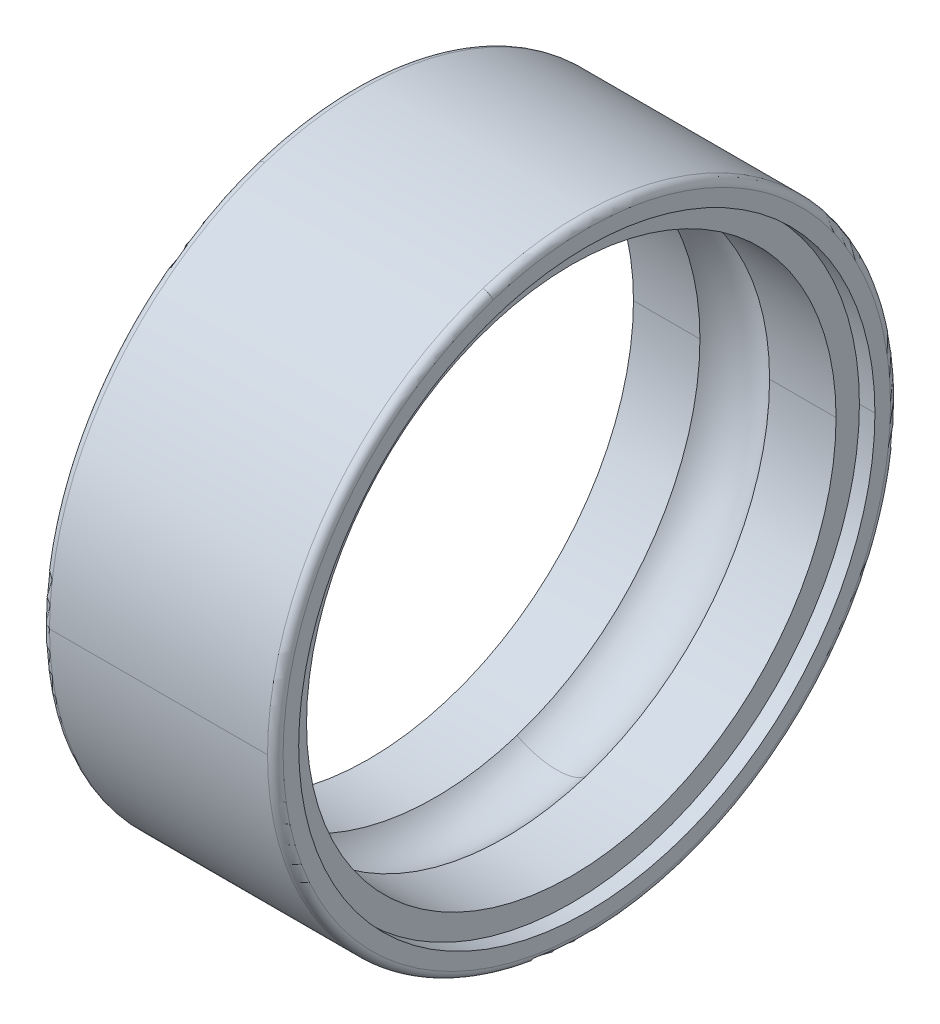
ISO-10303-21;
HEADER;
FILE_DESCRIPTION(('STEP AP214'),'2;1');
FILE_NAME('part.step','',(''),(''),'','','');
FILE_SCHEMA(('AUTOMOTIVE_DESIGN { 1 0 10303 214 1 1 1 1 }'));
ENDSEC;
DATA;
#1=APPLICATION_CONTEXT('core data for automotive mechanical design processes');
#2=APPLICATION_PROTOCOL_DEFINITION('international standard','automotive_design',2000,#1);
#3=PRODUCT_CONTEXT('',#1,'mechanical');
#4=PRODUCT('Part','Part','',(#3));
#5=PRODUCT_RELATED_PRODUCT_CATEGORY('part','',(#4));
#6=PRODUCT_DEFINITION_FORMATION('','',#4);
#7=PRODUCT_DEFINITION_CONTEXT('part definition',#1,'design');
#8=PRODUCT_DEFINITION('design','',#6,#7);
#9=PRODUCT_DEFINITION_SHAPE('','',#8);
#10=(LENGTH_UNIT() NAMED_UNIT(*) SI_UNIT(.MILLI.,.METRE.));
#11=(NAMED_UNIT(*) PLANE_ANGLE_UNIT() SI_UNIT($,.RADIAN.));
#12=(NAMED_UNIT(*) SI_UNIT($,.STERADIAN.) SOLID_ANGLE_UNIT());
#13=UNCERTAINTY_MEASURE_WITH_UNIT(LENGTH_MEASURE(1.E-05),#10,'distance_accuracy_value','');
#14=(GEOMETRIC_REPRESENTATION_CONTEXT(3) GLOBAL_UNCERTAINTY_ASSIGNED_CONTEXT((#13)) GLOBAL_UNIT_ASSIGNED_CONTEXT((#10,
#11,#12)) REPRESENTATION_CONTEXT('',''));
#15=CARTESIAN_POINT('',(0.,0.,0.));
#16=DIRECTION('',(0.,0.,1.));
#17=DIRECTION('',(1.,0.,0.));
#18=AXIS2_PLACEMENT_3D('',#15,#16,#17);
#19=CARTESIAN_POINT('',(0.,3.9,0.));
#20=DIRECTION('',(-1.,0.,0.));
#21=DIRECTION('',(0.,0.,1.));
#22=AXIS2_PLACEMENT_3D('',#19,#20,#21);
#23=PLANE('',#22);
#24=CARTESIAN_POINT('',(0.,0.,0.));
#25=DIRECTION('',(1.,0.,0.));
#26=DIRECTION('',(0.,0.,-1.));
#27=AXIS2_PLACEMENT_3D('',#24,#25,#26);
#28=CIRCLE('',#27,3.7);
#29=CARTESIAN_POINT('',(0.,0.,-3.7));
#30=VERTEX_POINT('',#29);
#31=CARTESIAN_POINT('',(0.,0.,3.7));
#32=VERTEX_POINT('',#31);
#33=EDGE_CURVE('E10',#30,#32,#28,.T.);
#34=ORIENTED_EDGE('',*,*,#33,.T.);
#35=CARTESIAN_POINT('',(0.,0.,0.));
#36=DIRECTION('',(1.,0.,0.));
#37=DIRECTION('',(0.,0.,-1.));
#38=AXIS2_PLACEMENT_3D('',#35,#36,#37);
#39=CIRCLE('',#38,3.7);
#40=EDGE_CURVE('E25',#32,#30,#39,.T.);
#41=ORIENTED_EDGE('',*,*,#40,.T.);
#42=EDGE_LOOP('',(#34,#41));
#43=FACE_BOUND('',#42,.T.);
#44=CARTESIAN_POINT('',(0.,3.70912041355117,1.20516627806233));
#45=CARTESIAN_POINT('',(0.,3.68940219391968,1.26585709849577));
#46=CARTESIAN_POINT('',(0.,3.66819191585444,1.32606299864661));
#47=CARTESIAN_POINT('',(0.,3.62284390240638,1.44536203134071));
#48=CARTESIAN_POINT('',(0.,3.59870616702355,1.50445516388398));
#49=CARTESIAN_POINT('',(0.,3.54755989849023,1.6213857343206));
#50=CARTESIAN_POINT('',(0.,3.52055136533974,1.67922317221394));
#51=CARTESIAN_POINT('',(0.,3.46372896653622,1.79350316969279));
#52=CARTESIAN_POINT('',(0.,3.43391510088321,1.8499457292783));
#53=CARTESIAN_POINT('',(0.,3.37155375428473,1.96129995439804));
#54=CARTESIAN_POINT('',(0.,3.33900627333927,2.01621161993228));
#55=CARTESIAN_POINT('',(0.,3.27125613455987,2.12437178083599));
#56=CARTESIAN_POINT('',(0.,3.23605347672594,2.17762027620546));
#57=CARTESIAN_POINT('',(0.,3.16307778277318,2.28232581357002));
#58=CARTESIAN_POINT('',(0.,3.12530474665436,2.33378285556512));
#59=CARTESIAN_POINT('',(0.,3.0472792967429,2.43478152244215));
#60=CARTESIAN_POINT('',(0.,3.00702688295025,2.48432314732409));
#61=CARTESIAN_POINT('',(0.,2.92413964873009,2.58137162965146));
#62=CARTESIAN_POINT('',(0.,2.88150482830257,2.62887848709689));
#63=CARTESIAN_POINT('',(0.,2.79395549197721,2.72174298642673));
#64=CARTESIAN_POINT('',(0.,2.74904097607939,2.76710062831115));
#65=CARTESIAN_POINT('',(0.,2.65704045177666,2.85555742597174));
#66=CARTESIAN_POINT('',(0.,2.60995444337177,2.89865658174792));
#67=CARTESIAN_POINT('',(0.,2.51372436838403,2.98249257755478));
#68=CARTESIAN_POINT('',(0.,2.46458030180119,3.02322941758546));
#69=CARTESIAN_POINT('',(0.,2.3643525028156,3.10224264328448));
#70=CARTESIAN_POINT('',(0.,2.31326877041286,3.14051902895281));
#71=CARTESIAN_POINT('',(0.,2.20928470497402,3.21451913476174));
#72=CARTESIAN_POINT('',(0.,2.15638437193792,3.25024285490233));
#73=CARTESIAN_POINT('',(0.,2.04889454676795,3.31905156808484));
#74=CARTESIAN_POINT('',(0.,1.99430505463409,3.35213656112676));
#75=CARTESIAN_POINT('',(0.,1.88356842213668,3.41558811546582));
#76=CARTESIAN_POINT('',(0.,1.82742128177313,3.44595467676295));
#77=CARTESIAN_POINT('',(0.,1.71370461619539,3.50389621190646));
#78=CARTESIAN_POINT('',(0.,1.65613509098119,3.53147118575284));
#79=CARTESIAN_POINT('',(0.,1.53971234573088,3.58376311546755));
#80=CARTESIAN_POINT('',(0.,1.48085912569477,3.6084800713359));
#81=CARTESIAN_POINT('',(0.,1.36201077336264,3.65499641978291));
#82=CARTESIAN_POINT('',(0.,1.30201564106661,3.67679581236159));
#83=CARTESIAN_POINT('',(0.,1.18102799774331,3.71742451758314));
#84=CARTESIAN_POINT('',(0.,1.12003548671603,3.73625383022602));
#85=CARTESIAN_POINT('',(0.,0.99720002223158,3.77089701411258));
#86=CARTESIAN_POINT('',(0.,0.935357068774417,3.78671088535625));
#87=CARTESIAN_POINT('',(0.,0.81096970452189,3.81528508944345));
#88=CARTESIAN_POINT('',(0.,0.748425293726527,3.82804542228696));
#89=CARTESIAN_POINT('',(0.,0.62278568976145,3.85048180881434));
#90=CARTESIAN_POINT('',(0.,0.559690496591737,3.8601578624982));
#91=CARTESIAN_POINT('',(0.,0.433101329724791,3.87640238024543));
#92=CARTESIAN_POINT('',(0.,0.36960735602756,3.88297084430879));
#93=CARTESIAN_POINT('',(0.,0.242373590649629,3.89298435880976));
#94=CARTESIAN_POINT('',(0.,0.178633798968931,3.89642940924736));
#95=CARTESIAN_POINT('',(0.,0.0510619523651723,3.90018779706856));
#96=CARTESIAN_POINT('',(0.,-0.0127701025578872,3.90050113445214));
#97=CARTESIAN_POINT('',(0.,-0.14037269863503,3.89799534130811));
#98=CARTESIAN_POINT('',(0.,-0.204143239789114,3.89517621078049));
#99=CARTESIAN_POINT('',(0.,-0.331469179509025,3.88641227334639));
#100=CARTESIAN_POINT('',(0.,-0.395024578074853,3.88046746643991));
#101=CARTESIAN_POINT('',(0.,-0.521767122096312,3.86546649780866));
#102=CARTESIAN_POINT('',(0.,-0.584954267551943,3.85641033608388));
#103=CARTESIAN_POINT('',(0.,-0.710808081985066,3.83520847490283));
#104=CARTESIAN_POINT('',(0.,-0.773474750962558,3.82306277544657));
#105=CARTESIAN_POINT('',(0.,-0.898136642944884,3.79571109885638));
#106=CARTESIAN_POINT('',(0.,-0.960131865949718,3.78050512172246));
#107=CARTESIAN_POINT('',(0.,-1.08330151406437,3.74706952230775));
#108=CARTESIAN_POINT('',(0.,-1.14447593917418,3.72883990002697));
#109=CARTESIAN_POINT('',(0.,-1.26585661695046,3.68940092707536));
#110=CARTESIAN_POINT('',(0.,-1.32606286961693,3.66819157640453));
#111=CARTESIAN_POINT('',(0.,-1.44536216037038,3.62284424185629));
#112=CARTESIAN_POINT('',(0.,-1.50445519845737,3.59870625797889));
#113=CARTESIAN_POINT('',(0.,-1.6213856997472,3.54755980753491));
#114=CARTESIAN_POINT('',(0.,-1.67922316295003,3.52055134096833));
#115=CARTESIAN_POINT('',(0.,-1.7935031789567,3.46372899090763));
#116=CARTESIAN_POINT('',(0.,-1.84994573176055,3.43391510741351));
#117=CARTESIAN_POINT('',(0.,-1.96129995191578,3.37155374775443));
#118=CARTESIAN_POINT('',(0.,-2.01621161926716,3.33900627158948));
#119=CARTESIAN_POINT('',(0.,-2.1243717815011,3.27125613630966));
#120=CARTESIAN_POINT('',(0.,-2.17762027638367,3.23605347719479));
#121=CARTESIAN_POINT('',(0.,-2.2823258133918,3.16307778230433));
#122=CARTESIAN_POINT('',(0.,-2.33378285551736,3.12530474652873));
#123=CARTESIAN_POINT('',(0.,-2.4347815224899,3.04727929686853));
#124=CARTESIAN_POINT('',(0.,-2.48432314733688,3.00702688298392));
#125=CARTESIAN_POINT('',(0.,-2.58137162963866,2.92413964869643));
#126=CARTESIAN_POINT('',(0.,-2.62887848709346,2.88150482829355));
#127=CARTESIAN_POINT('',(0.,-2.72174298643016,2.79395549198624));
#128=CARTESIAN_POINT('',(0.,-2.76710062831206,2.74904097608181));
#129=CARTESIAN_POINT('',(0.,-2.85555742597082,2.65704045177425));
#130=CARTESIAN_POINT('',(0.,-2.89865658174768,2.60995444337113));
#131=CARTESIAN_POINT('',(0.,-2.98249257755503,2.51372436838468));
#132=CARTESIAN_POINT('',(0.,-3.02322941758553,2.46458030180136));
#133=CARTESIAN_POINT('',(0.,-3.10224264328441,2.36435250281543));
#134=CARTESIAN_POINT('',(0.,-3.14051902895279,2.31326877041282));
#135=CARTESIAN_POINT('',(0.,-3.21451913476175,2.20928470497407));
#136=CARTESIAN_POINT('',(0.,-3.25024285490233,2.15638437193793));
#137=CARTESIAN_POINT('',(0.,-3.31905156808483,2.04889454676794));
#138=CARTESIAN_POINT('',(0.,-3.35213656112676,1.99430505463409));
#139=CARTESIAN_POINT('',(0.,-3.41558811546582,1.88356842213668));
#140=CARTESIAN_POINT('',(0.,-3.44595467676295,1.82742128177314));
#141=CARTESIAN_POINT('',(0.,-3.50389621190646,1.71370461619539));
#142=CARTESIAN_POINT('',(0.,-3.53147118575283,1.65613509098119));
#143=CARTESIAN_POINT('',(0.,-3.58376311546756,1.53971234573088));
#144=CARTESIAN_POINT('',(0.,-3.60848007133591,1.48085912569477));
#145=CARTESIAN_POINT('',(0.,-3.6549964197829,1.36201077336264));
#146=CARTESIAN_POINT('',(0.,-3.67679581236154,1.30201564106663));
#147=CARTESIAN_POINT('',(0.,-3.71742451758319,1.1810279977433));
#148=CARTESIAN_POINT('',(0.,-3.7362538302262,1.12003548671598));
#149=CARTESIAN_POINT('',(0.,-3.7708970141124,0.997200022231633));
#150=CARTESIAN_POINT('',(0.,-3.78671088535558,0.935357068774602));
#151=CARTESIAN_POINT('',(0.,-3.81528508944411,0.810969704521713));
#152=CARTESIAN_POINT('',(0.,-3.82804542228946,0.748425293725854));
#153=CARTESIAN_POINT('',(0.,-3.85048180881185,0.622785689762132));
#154=CARTESIAN_POINT('',(0.,-3.86015786248889,0.559690496594268));
#155=CARTESIAN_POINT('',(0.,-3.87640238025474,0.433101329722266));
#156=CARTESIAN_POINT('',(0.,-3.88297084434355,0.369607356018127));
#157=CARTESIAN_POINT('',(0.,-3.892984358775,0.242373590659066));
#158=CARTESIAN_POINT('',(0.,-3.89642940911766,0.178633799004143));
#159=CARTESIAN_POINT('',(0.,-3.90018779719826,0.0510619523299664));
#160=CARTESIAN_POINT('',(0.,-3.90050113493621,-0.0127701026892876));
#161=CARTESIAN_POINT('',(0.,-3.89799534082405,-0.140372698503622));
#162=CARTESIAN_POINT('',(0.,-3.89517620897393,-0.204143239298703));
#163=CARTESIAN_POINT('',(0.,-3.88641227515294,-0.331469179999429));
#164=CARTESIAN_POINT('',(0.,-3.88046747318207,-0.395024579905075));
#165=CARTESIAN_POINT('',(0.,-3.8654664910665,-0.521767120266086));
#166=CARTESIAN_POINT('',(0.,-3.85641031092181,-0.584954260721451));
#167=CARTESIAN_POINT('',(0.,-3.83520850006491,-0.710808088815554));
#168=CARTESIAN_POINT('',(0.,-3.82306286935271,-0.773474776454291));
#169=CARTESIAN_POINT('',(0.,-3.79571100495024,-0.898136617453145));
#170=CARTESIAN_POINT('',(0.,-3.78050477125997,-0.960131770813262));
#171=CARTESIAN_POINT('',(0.,-3.74706987277024,-1.08330160920082));
#172=CARTESIAN_POINT('',(0.,-3.72884120797078,-1.14447629422825));
#173=CARTESIAN_POINT('',(0.,-3.70912041355117,-1.20516627806232));
#174=B_SPLINE_CURVE_WITH_KNOTS('',3,(#44,#45,#46,#47,#48,#49,#50,#51,#52,#53,#54,#55,#56,#57,
#58,#59,#60,#61,#62,#63,#64,#65,#66,#67,#68,#69,#70,#71,#72,#73,#74,#75,#76,#77,#78,#79,#80,#81,
#82,#83,#84,#85,#86,#87,#88,#89,#90,#91,#92,#93,#94,#95,#96,#97,#98,#99,#100,#101,#102,#103,
#104,#105,#106,#107,#108,#109,#110,#111,#112,#113,#114,#115,#116,#117,#118,#119,#120,#121,#122,
#123,#124,#125,#126,#127,#128,#129,#130,#131,#132,#133,#134,#135,#136,#137,#138,#139,#140,#141,
#142,#143,#144,#145,#146,#147,#148,#149,#150,#151,#152,#153,#154,#155,#156,#157,#158,#159,#160,
#161,#162,#163,#164,#165,#166,#167,#168,#169,#170,#171,#172,#173),.UNSPECIFIED.,.F.,.F.,(4,2,2,
2,2,2,2,2,2,2,2,2,2,2,2,2,2,2,2,2,2,2,2,2,2,2,2,2,2,2,2,2,2,2,2,2,2,2,2,2,2,2,2,2,2,2,2,2,2,2,2,
2,2,2,2,2,2,2,2,2,2,2,2,2,4),(0.,0.191421582478719,0.382843164957439,0.574264747436158,
0.765686329914878,0.957107912393597,1.14852949487232,1.33995107735104,1.53137265982976,
1.72279424230847,1.91421582478719,2.10563740726591,2.29705898974463,2.48848057222335,
2.67990215470207,2.87132373718079,3.06274531965951,3.25416690213823,3.44558848461695,
3.63701006709567,3.82843164957439,4.01985323205311,4.21127481453183,4.40269639701055,
4.59411797948926,4.78553956196799,4.9769611444467,5.16838272692542,5.35980430940414,
5.55122589188286,5.74264747436158,5.9340690568403,6.12549063931902,6.31691222179774,
6.50833380427646,6.69975538675518,6.8911769692339,7.08259855171262,7.27402013419134,
7.46544171667006,7.65686329914878,7.84828488162749,8.03970646410621,8.23112804658494,
8.42254962906365,8.61397121154237,8.80539279402109,8.99681437649981,9.18823595897853,
9.37965754145725,9.57107912393597,9.76250070641469,9.95392228889341,10.1453438713721,
10.3367654538508,10.5281870363296,10.7196086188083,10.911030201287,11.1024517837657,
11.2938733662444,11.4852949487232,11.6767165312019,11.8681381136806,12.0595596961593,
12.250981278638),.UNSPECIFIED.);
#175=CARTESIAN_POINT('',(0.,3.70912041355117,1.20516627806232));
#176=VERTEX_POINT('',#175);
#177=CARTESIAN_POINT('',(0.,-3.70912041355117,-1.20516627806232));
#178=VERTEX_POINT('',#177);
#179=EDGE_CURVE('E317',#176,#178,#174,.T.);
#180=ORIENTED_EDGE('',*,*,#179,.F.);
#181=CARTESIAN_POINT('',(0.,-3.70912041355117,-1.20516627806233));
#182=CARTESIAN_POINT('',(0.,-3.68940219391968,-1.26585709849577));
#183=CARTESIAN_POINT('',(0.,-3.66819191585444,-1.32606299864661));
#184=CARTESIAN_POINT('',(0.,-3.62284390240638,-1.44536203134071));
#185=CARTESIAN_POINT('',(0.,-3.59870616702355,-1.50445516388398));
#186=CARTESIAN_POINT('',(0.,-3.54755989849024,-1.6213857343206));
#187=CARTESIAN_POINT('',(0.,-3.52055136533974,-1.67922317221394));
#188=CARTESIAN_POINT('',(0.,-3.46372896653623,-1.79350316969279));
#189=CARTESIAN_POINT('',(0.,-3.43391510088321,-1.8499457292783));
#190=CARTESIAN_POINT('',(0.,-3.37155375428473,-1.96129995439804));
#191=CARTESIAN_POINT('',(0.,-3.33900627333927,-2.01621161993228));
#192=CARTESIAN_POINT('',(0.,-3.27125613455987,-2.12437178083599));
#193=CARTESIAN_POINT('',(0.,-3.23605347672594,-2.17762027620545));
#194=CARTESIAN_POINT('',(0.,-3.16307778277318,-2.28232581357002));
#195=CARTESIAN_POINT('',(0.,-3.12530474665436,-2.33378285556512));
#196=CARTESIAN_POINT('',(0.,-3.0472792967429,-2.43478152244215));
#197=CARTESIAN_POINT('',(0.,-3.00702688295026,-2.48432314732409));
#198=CARTESIAN_POINT('',(0.,-2.92413964873009,-2.58137162965145));
#199=CARTESIAN_POINT('',(0.,-2.88150482830257,-2.62887848709689));
#200=CARTESIAN_POINT('',(0.,-2.79395549197722,-2.72174298642673));
#201=CARTESIAN_POINT('',(0.,-2.74904097607939,-2.76710062831114));
#202=CARTESIAN_POINT('',(0.,-2.65704045177667,-2.85555742597174));
#203=CARTESIAN_POINT('',(0.,-2.60995444337178,-2.89865658174792));
#204=CARTESIAN_POINT('',(0.,-2.51372436838404,-2.98249257755478));
#205=CARTESIAN_POINT('',(0.,-2.46458030180119,-3.02322941758546));
#206=CARTESIAN_POINT('',(0.,-2.3643525028156,-3.10224264328447));
#207=CARTESIAN_POINT('',(0.,-2.31326877041286,-3.14051902895281));
#208=CARTESIAN_POINT('',(0.,-2.20928470497402,-3.21451913476174));
#209=CARTESIAN_POINT('',(0.,-2.15638437193792,-3.25024285490233));
#210=CARTESIAN_POINT('',(0.,-2.04889454676795,-3.31905156808484));
#211=CARTESIAN_POINT('',(0.,-1.99430505463409,-3.35213656112676));
#212=CARTESIAN_POINT('',(0.,-1.88356842213668,-3.41558811546582));
#213=CARTESIAN_POINT('',(0.,-1.82742128177313,-3.44595467676295));
#214=CARTESIAN_POINT('',(0.,-1.71370461619539,-3.50389621190646));
#215=CARTESIAN_POINT('',(0.,-1.65613509098119,-3.53147118575283));
#216=CARTESIAN_POINT('',(0.,-1.53971234573088,-3.58376311546755));
#217=CARTESIAN_POINT('',(0.,-1.48085912569477,-3.6084800713359));
#218=CARTESIAN_POINT('',(0.,-1.36201077336264,-3.65499641978291));
#219=CARTESIAN_POINT('',(0.,-1.30201564106662,-3.67679581236159));
#220=CARTESIAN_POINT('',(0.,-1.18102799774331,-3.71742451758314));
#221=CARTESIAN_POINT('',(0.,-1.12003548671603,-3.73625383022602));
#222=CARTESIAN_POINT('',(0.,-0.997200022231584,-3.77089701411258));
#223=CARTESIAN_POINT('',(0.,-0.935357068774421,-3.78671088535625));
#224=CARTESIAN_POINT('',(0.,-0.810969704521895,-3.81528508944345));
#225=CARTESIAN_POINT('',(0.,-0.748425293726532,-3.82804542228696));
#226=CARTESIAN_POINT('',(0.,-0.622785689761455,-3.85048180881434));
#227=CARTESIAN_POINT('',(0.,-0.559690496591742,-3.8601578624982));
#228=CARTESIAN_POINT('',(0.,-0.433101329724797,-3.87640238024543));
#229=CARTESIAN_POINT('',(0.,-0.369607356027565,-3.88297084430879));
#230=CARTESIAN_POINT('',(0.,-0.242373590649634,-3.89298435880976));
#231=CARTESIAN_POINT('',(0.,-0.178633798968935,-3.89642940924736));
#232=CARTESIAN_POINT('',(0.,-0.0510619523651768,-3.90018779706855));
#233=CARTESIAN_POINT('',(0.,0.0127701025578822,-3.90050113445214));
#234=CARTESIAN_POINT('',(0.,0.140372698635024,-3.89799534130811));
#235=CARTESIAN_POINT('',(0.,0.204143239789108,-3.89517621078049));
#236=CARTESIAN_POINT('',(0.,0.331469179509019,-3.88641227334639));
#237=CARTESIAN_POINT('',(0.,0.395024578074846,-3.88046746643991));
#238=CARTESIAN_POINT('',(0.,0.521767122096305,-3.86546649780866));
#239=CARTESIAN_POINT('',(0.,0.584954267551936,-3.85641033608388));
#240=CARTESIAN_POINT('',(0.,0.710808081985059,-3.83520847490284));
#241=CARTESIAN_POINT('',(0.,0.773474750962551,-3.82306277544657));
#242=CARTESIAN_POINT('',(0.,0.898136642944877,-3.79571109885638));
#243=CARTESIAN_POINT('',(0.,0.96013186594971,-3.78050512172246));
#244=CARTESIAN_POINT('',(0.,1.08330151406436,-3.74706952230776));
#245=CARTESIAN_POINT('',(0.,1.14447593917418,-3.72883990002698));
#246=CARTESIAN_POINT('',(0.,1.26585661695046,-3.68940092707536));
#247=CARTESIAN_POINT('',(0.,1.32606286961692,-3.66819157640453));
#248=CARTESIAN_POINT('',(0.,1.44536216037038,-3.62284424185629));
#249=CARTESIAN_POINT('',(0.,1.50445519845737,-3.59870625797889));
#250=CARTESIAN_POINT('',(0.,1.62138569974719,-3.54755980753491));
#251=CARTESIAN_POINT('',(0.,1.67922316295002,-3.52055134096834));
#252=CARTESIAN_POINT('',(0.,1.7935031789567,-3.46372899090764));
#253=CARTESIAN_POINT('',(0.,1.84994573176055,-3.43391510741351));
#254=CARTESIAN_POINT('',(0.,1.96129995191577,-3.37155374775444));
#255=CARTESIAN_POINT('',(0.,2.01621161926715,-3.33900627158949));
#256=CARTESIAN_POINT('',(0.,2.1243717815011,-3.27125613630967));
#257=CARTESIAN_POINT('',(0.,2.17762027638366,-3.2360534771948));
#258=CARTESIAN_POINT('',(0.,2.28232581339179,-3.16307778230433));
#259=CARTESIAN_POINT('',(0.,2.33378285551736,-3.12530474652874));
#260=CARTESIAN_POINT('',(0.,2.4347815224899,-3.04727929686853));
#261=CARTESIAN_POINT('',(0.,2.48432314733687,-3.00702688298392));
#262=CARTESIAN_POINT('',(0.,2.58137162963865,-2.92413964869643));
#263=CARTESIAN_POINT('',(0.,2.62887848709345,-2.88150482829355));
#264=CARTESIAN_POINT('',(0.,2.72174298643015,-2.79395549198624));
#265=CARTESIAN_POINT('',(0.,2.76710062831206,-2.74904097608181));
#266=CARTESIAN_POINT('',(0.,2.85555742597081,-2.65704045177426));
#267=CARTESIAN_POINT('',(0.,2.89865658174767,-2.60995444337114));
#268=CARTESIAN_POINT('',(0.,2.98249257755502,-2.51372436838469));
#269=CARTESIAN_POINT('',(0.,3.02322941758552,-2.46458030180137));
#270=CARTESIAN_POINT('',(0.,3.1022426432844,-2.36435250281544));
#271=CARTESIAN_POINT('',(0.,3.14051902895279,-2.31326877041282));
#272=CARTESIAN_POINT('',(0.,3.21451913476175,-2.20928470497408));
#273=CARTESIAN_POINT('',(0.,3.25024285490233,-2.15638437193794));
#274=CARTESIAN_POINT('',(0.,3.31905156808483,-2.04889454676795));
#275=CARTESIAN_POINT('',(0.,3.35213656112675,-1.9943050546341));
#276=CARTESIAN_POINT('',(0.,3.41558811546581,-1.88356842213669));
#277=CARTESIAN_POINT('',(0.,3.44595467676294,-1.82742128177315));
#278=CARTESIAN_POINT('',(0.,3.50389621190645,-1.7137046161954));
#279=CARTESIAN_POINT('',(0.,3.53147118575283,-1.6561350909812));
#280=CARTESIAN_POINT('',(0.,3.58376311546755,-1.53971234573089));
#281=CARTESIAN_POINT('',(0.,3.60848007133591,-1.48085912569478));
#282=CARTESIAN_POINT('',(0.,3.6549964197829,-1.36201077336265));
#283=CARTESIAN_POINT('',(0.,3.67679581236153,-1.30201564106664));
#284=CARTESIAN_POINT('',(0.,3.71742451758318,-1.18102799774331));
#285=CARTESIAN_POINT('',(0.,3.7362538302262,-1.12003548671599));
#286=CARTESIAN_POINT('',(0.,3.77089701411239,-0.997200022231643));
#287=CARTESIAN_POINT('',(0.,3.78671088535558,-0.935357068774613));
#288=CARTESIAN_POINT('',(0.,3.81528508944411,-0.810969704521724));
#289=CARTESIAN_POINT('',(0.,3.82804542228946,-0.748425293725865));
#290=CARTESIAN_POINT('',(0.,3.85048180881184,-0.622785689762144));
#291=CARTESIAN_POINT('',(0.,3.86015786248889,-0.559690496594281));
#292=CARTESIAN_POINT('',(0.,3.87640238025474,-0.43310132972228));
#293=CARTESIAN_POINT('',(0.,3.88297084434354,-0.369607356018142));
#294=CARTESIAN_POINT('',(0.,3.892984358775,-0.242373590659081));
#295=CARTESIAN_POINT('',(0.,3.89642940911766,-0.178633799004158));
#296=CARTESIAN_POINT('',(0.,3.90018779719826,-0.0510619523299806));
#297=CARTESIAN_POINT('',(0.,3.90050113493621,0.0127701026892732));
#298=CARTESIAN_POINT('',(0.,3.89799534082405,0.140372698503608));
#299=CARTESIAN_POINT('',(0.,3.89517620897393,0.204143239298688));
#300=CARTESIAN_POINT('',(0.,3.88641227515294,0.331469179999415));
#301=CARTESIAN_POINT('',(0.,3.88046747318207,0.39502457990506));
#302=CARTESIAN_POINT('',(0.,3.8654664910665,0.521767120266071));
#303=CARTESIAN_POINT('',(0.,3.85641031092181,0.584954260721437));
#304=CARTESIAN_POINT('',(0.,3.83520850006491,0.710808088815539));
#305=CARTESIAN_POINT('',(0.,3.82306286935271,0.773474776454277));
#306=CARTESIAN_POINT('',(0.,3.79571100495024,0.898136617453131));
#307=CARTESIAN_POINT('',(0.,3.78050477125997,0.960131770813248));
#308=CARTESIAN_POINT('',(0.,3.74706987277025,1.0833016092008));
#309=CARTESIAN_POINT('',(0.,3.72884120797079,1.14447629422824));
#310=CARTESIAN_POINT('',(0.,3.70912041355117,1.20516627806231));
#311=B_SPLINE_CURVE_WITH_KNOTS('',3,(#181,#182,#183,#184,#185,#186,#187,#188,#189,#190,#191,
#192,#193,#194,#195,#196,#197,#198,#199,#200,#201,#202,#203,#204,#205,#206,#207,#208,#209,#210,
#211,#212,#213,#214,#215,#216,#217,#218,#219,#220,#221,#222,#223,#224,#225,#226,#227,#228,#229,
#230,#231,#232,#233,#234,#235,#236,#237,#238,#239,#240,#241,#242,#243,#244,#245,#246,#247,#248,
#249,#250,#251,#252,#253,#254,#255,#256,#257,#258,#259,#260,#261,#262,#263,#264,#265,#266,#267,
#268,#269,#270,#271,#272,#273,#274,#275,#276,#277,#278,#279,#280,#281,#282,#283,#284,#285,#286,
#287,#288,#289,#290,#291,#292,#293,#294,#295,#296,#297,#298,#299,#300,#301,#302,#303,#304,#305,
#306,#307,#308,#309,#310),.UNSPECIFIED.,.F.,.F.,(4,2,2,2,2,2,2,2,2,2,2,2,2,2,2,2,2,2,2,2,2,2,2,
2,2,2,2,2,2,2,2,2,2,2,2,2,2,2,2,2,2,2,2,2,2,2,2,2,2,2,2,2,2,2,2,2,2,2,2,2,2,2,2,2,4),(0.,
0.191421582478719,0.382843164957439,0.574264747436157,0.765686329914877,0.957107912393596,
1.14852949487232,1.33995107735103,1.53137265982975,1.72279424230847,1.91421582478719,
2.10563740726591,2.29705898974463,2.48848057222335,2.67990215470207,2.87132373718079,
3.06274531965951,3.25416690213823,3.44558848461695,3.63701006709567,3.82843164957439,
4.0198532320531,4.21127481453182,4.40269639701054,4.59411797948926,4.78553956196798,
4.9769611444467,5.16838272692542,5.35980430940414,5.55122589188286,5.74264747436158,
5.93406905684029,6.12549063931901,6.31691222179773,6.50833380427645,6.69975538675517,
6.89117696923389,7.08259855171261,7.27402013419133,7.46544171667005,7.65686329914877,
7.84828488162748,8.0397064641062,8.23112804658492,8.42254962906364,8.61397121154236,
8.80539279402108,8.9968143764998,9.18823595897851,9.37965754145724,9.57107912393596,
9.76250070641468,9.95392228889339,10.1453438713721,10.3367654538508,10.5281870363295,
10.7196086188083,10.911030201287,11.1024517837657,11.2938733662444,11.4852949487231,
11.6767165312019,11.8681381136806,12.0595596961593,12.250981278638),.UNSPECIFIED.);
#312=EDGE_CURVE('E419',#178,#176,#311,.T.);
#313=ORIENTED_EDGE('',*,*,#312,.F.);
#314=EDGE_LOOP('',(#180,#313));
#315=FACE_BOUND('',#314,.T.);
#316=ADVANCED_FACE('F16',(#43,#315),#23,.T.);
#317=CARTESIAN_POINT('',(0.099999999999923,0.,0.));
#318=DIRECTION('',(1.,0.,0.));
#319=DIRECTION('',(0.,-0.309016994374947,0.951056516295154));
#320=AXIS2_PLACEMENT_3D('',#317,#318,#319);
#321=TOROIDAL_SURFACE('',#320,3.90000000000007,0.0999999999999235);
#322=CARTESIAN_POINT('',(0.099999999999923,-3.70912041355117,-1.20516627806232));
#323=DIRECTION('',(0.,0.309016994374948,-0.951056516295154));
#324=DIRECTION('',(7.69384556065822E-13,-0.951056516295154,-0.309016994374948));
#325=AXIS2_PLACEMENT_3D('',#322,#323,#324);
#326=CIRCLE('',#325,0.0999999999999235);
#327=CARTESIAN_POINT('',(0.0999999999999999,-3.80422606518061,-1.23606797749979));
#328=VERTEX_POINT('',#327);
#329=EDGE_CURVE('E382',#328,#178,#326,.T.);
#330=ORIENTED_EDGE('',*,*,#329,.T.);
#331=ORIENTED_EDGE('',*,*,#312,.T.);
#332=CARTESIAN_POINT('',(0.099999999999923,3.70912041355117,1.20516627806232));
#333=DIRECTION('',(0.,-0.309016994374948,0.951056516295154));
#334=DIRECTION('',(7.69384556065822E-13,0.951056516295154,0.309016994374948));
#335=AXIS2_PLACEMENT_3D('',#332,#333,#334);
#336=CIRCLE('',#335,0.0999999999999235);
#337=CARTESIAN_POINT('',(0.0999999999999999,3.80422606518061,1.23606797749979));
#338=VERTEX_POINT('',#337);
#339=EDGE_CURVE('E378',#338,#176,#336,.T.);
#340=ORIENTED_EDGE('',*,*,#339,.F.);
#341=CARTESIAN_POINT('',(0.1,0.,0.));
#342=DIRECTION('',(1.,0.,0.));
#343=DIRECTION('',(0.,0.,-1.));
#344=AXIS2_PLACEMENT_3D('',#341,#342,#343);
#345=CIRCLE('',#344,4.);
#346=CARTESIAN_POINT('',(0.1,0.,-4.));
#347=VERTEX_POINT('',#346);
#348=EDGE_CURVE('E373',#347,#338,#345,.T.);
#349=ORIENTED_EDGE('',*,*,#348,.F.);
#350=CARTESIAN_POINT('',(0.1,0.,0.));
#351=DIRECTION('',(1.,0.,0.));
#352=DIRECTION('',(0.,0.,-1.));
#353=AXIS2_PLACEMENT_3D('',#350,#351,#352);
#354=CIRCLE('',#353,4.);
#355=EDGE_CURVE('E368',#328,#347,#354,.T.);
#356=ORIENTED_EDGE('',*,*,#355,.F.);
#357=EDGE_LOOP('',(#330,#331,#340,#349,#356));
#358=FACE_BOUND('',#357,.T.);
#359=ADVANCED_FACE('F390',(#358),#321,.T.);
#360=CARTESIAN_POINT('',(3.,0.,0.));
#361=DIRECTION('',(1.,0.,0.));
#362=DIRECTION('',(0.,1.,0.));
#363=AXIS2_PLACEMENT_3D('',#360,#361,#362);
#364=CYLINDRICAL_SURFACE('',#363,4.);
#365=DIRECTION('',(1.,0.,0.));
#366=VECTOR('',#365,1.);
#367=CARTESIAN_POINT('',(0.1,0.,4.));
#368=LINE('',#367,#366);
#369=CARTESIAN_POINT('',(0.1,0.,4.));
#370=VERTEX_POINT('',#369);
#371=CARTESIAN_POINT('',(2.9,0.,4.));
#372=VERTEX_POINT('',#371);
#373=EDGE_CURVE('E363',#370,#372,#368,.T.);
#374=ORIENTED_EDGE('',*,*,#373,.F.);
#375=CARTESIAN_POINT('',(0.1,0.,0.));
#376=DIRECTION('',(1.,0.,0.));
#377=DIRECTION('',(0.,0.,-1.));
#378=AXIS2_PLACEMENT_3D('',#375,#376,#377);
#379=CIRCLE('',#378,4.);
#380=EDGE_CURVE('E358',#370,#328,#379,.T.);
#381=ORIENTED_EDGE('',*,*,#380,.T.);
#382=ORIENTED_EDGE('',*,*,#355,.T.);
#383=DIRECTION('',(1.,0.,0.));
#384=VECTOR('',#383,1.);
#385=CARTESIAN_POINT('',(0.1,0.,-4.));
#386=LINE('',#385,#384);
#387=CARTESIAN_POINT('',(2.9,0.,-4.));
#388=VERTEX_POINT('',#387);
#389=EDGE_CURVE('E354',#347,#388,#386,.T.);
#390=ORIENTED_EDGE('',*,*,#389,.T.);
#391=CARTESIAN_POINT('',(2.9,0.,0.));
#392=DIRECTION('',(1.,0.,0.));
#393=DIRECTION('',(0.,0.,-1.));
#394=AXIS2_PLACEMENT_3D('',#391,#392,#393);
#395=CIRCLE('',#394,4.);
#396=CARTESIAN_POINT('',(2.9,-3.80422606518062,-1.23606797749979));
#397=VERTEX_POINT('',#396);
#398=EDGE_CURVE('E349',#397,#388,#395,.T.);
#399=ORIENTED_EDGE('',*,*,#398,.F.);
#400=CARTESIAN_POINT('',(2.9,0.,0.));
#401=DIRECTION('',(1.,0.,0.));
#402=DIRECTION('',(0.,0.,-1.));
#403=AXIS2_PLACEMENT_3D('',#400,#401,#402);
#404=CIRCLE('',#403,4.);
#405=EDGE_CURVE('E344',#372,#397,#404,.T.);
#406=ORIENTED_EDGE('',*,*,#405,.F.);
#407=EDGE_LOOP('',(#374,#381,#382,#390,#399,#406));
#408=FACE_BOUND('',#407,.T.);
#409=ADVANCED_FACE('F399',(#408),#364,.T.);
#410=CARTESIAN_POINT('',(2.90000000000015,0.,0.));
#411=DIRECTION('',(1.,0.,0.));
#412=DIRECTION('',(0.,0.309016994374947,-0.951056516295154));
#413=AXIS2_PLACEMENT_3D('',#410,#411,#412);
#414=TOROIDAL_SURFACE('',#413,3.90000000000015,0.0999999999998463);
#415=CARTESIAN_POINT('',(2.90000000000015,-3.70912041355125,-1.20516627806234));
#416=DIRECTION('',(0.,0.309016994374947,-0.951056516295154));
#417=DIRECTION('',(1.,0.,0.));
#418=AXIS2_PLACEMENT_3D('',#415,#416,#417);
#419=CIRCLE('',#418,0.0999999999998464);
#420=CARTESIAN_POINT('',(3.,-3.70912041355125,-1.20516627806234));
#421=VERTEX_POINT('',#420);
#422=EDGE_CURVE('E340',#421,#397,#419,.T.);
#423=ORIENTED_EDGE('',*,*,#422,.F.);
#424=CARTESIAN_POINT('',(3.,0.,0.));
#425=DIRECTION('',(1.,0.,0.));
#426=DIRECTION('',(0.,0.,-1.));
#427=AXIS2_PLACEMENT_3D('',#424,#425,#426);
#428=CIRCLE('',#427,3.9);
#429=CARTESIAN_POINT('',(3.,3.70912041355125,1.20516627806234));
#430=VERTEX_POINT('',#429);
#431=EDGE_CURVE('E335',#430,#421,#428,.T.);
#432=ORIENTED_EDGE('',*,*,#431,.F.);
#433=CARTESIAN_POINT('',(2.90000000000015,3.70912041355125,1.20516627806234));
#434=DIRECTION('',(0.,-0.309016994374947,0.951056516295154));
#435=DIRECTION('',(1.,0.,0.));
#436=AXIS2_PLACEMENT_3D('',#433,#434,#435);
#437=CIRCLE('',#436,0.0999999999998464);
#438=CARTESIAN_POINT('',(2.9,3.80422606518062,1.23606797749979));
#439=VERTEX_POINT('',#438);
#440=EDGE_CURVE('E331',#430,#439,#437,.T.);
#441=ORIENTED_EDGE('',*,*,#440,.T.);
#442=CARTESIAN_POINT('',(2.9,0.,0.));
#443=DIRECTION('',(1.,0.,0.));
#444=DIRECTION('',(0.,0.,-1.));
#445=AXIS2_PLACEMENT_3D('',#442,#443,#444);
#446=CIRCLE('',#445,4.);
#447=EDGE_CURVE('E326',#439,#372,#446,.T.);
#448=ORIENTED_EDGE('',*,*,#447,.T.);
#449=ORIENTED_EDGE('',*,*,#405,.T.);
#450=EDGE_LOOP('',(#423,#432,#441,#448,#449));
#451=FACE_BOUND('',#450,.T.);
#452=ADVANCED_FACE('F403',(#451),#414,.T.);
#453=CARTESIAN_POINT('',(3.,0.,0.));
#454=DIRECTION('',(1.,0.,0.));
#455=DIRECTION('',(0.,-1.,0.));
#456=AXIS2_PLACEMENT_3D('',#453,#454,#455);
#457=CYLINDRICAL_SURFACE('',#456,4.);
#458=ORIENTED_EDGE('',*,*,#373,.T.);
#459=ORIENTED_EDGE('',*,*,#447,.F.);
#460=CARTESIAN_POINT('',(2.9,0.,0.));
#461=DIRECTION('',(1.,0.,0.));
#462=DIRECTION('',(0.,0.,-1.));
#463=AXIS2_PLACEMENT_3D('',#460,#461,#462);
#464=CIRCLE('',#463,4.);
#465=EDGE_CURVE('E321',#388,#439,#464,.T.);
#466=ORIENTED_EDGE('',*,*,#465,.F.);
#467=ORIENTED_EDGE('',*,*,#389,.F.);
#468=ORIENTED_EDGE('',*,*,#348,.T.);
#469=CARTESIAN_POINT('',(0.1,0.,0.));
#470=DIRECTION('',(1.,0.,0.));
#471=DIRECTION('',(0.,0.,-1.));
#472=AXIS2_PLACEMENT_3D('',#469,#470,#471);
#473=CIRCLE('',#472,4.);
#474=EDGE_CURVE('E318',#338,#370,#473,.T.);
#475=ORIENTED_EDGE('',*,*,#474,.T.);
#476=EDGE_LOOP('',(#458,#459,#466,#467,#468,#475));
#477=FACE_BOUND('',#476,.T.);
#478=ADVANCED_FACE('F406',(#477),#457,.T.);
#479=CARTESIAN_POINT('',(0.099999999999923,0.,0.));
#480=DIRECTION('',(1.,0.,0.));
#481=DIRECTION('',(0.,0.309016994374947,-0.951056516295154));
#482=AXIS2_PLACEMENT_3D('',#479,#480,#481);
#483=TOROIDAL_SURFACE('',#482,3.90000000000007,0.0999999999999235);
#484=ORIENTED_EDGE('',*,*,#329,.F.);
#485=ORIENTED_EDGE('',*,*,#380,.F.);
#486=ORIENTED_EDGE('',*,*,#474,.F.);
#487=ORIENTED_EDGE('',*,*,#339,.T.);
#488=ORIENTED_EDGE('',*,*,#179,.T.);
#489=EDGE_LOOP('',(#484,#485,#486,#487,#488));
#490=FACE_BOUND('',#489,.T.);
#491=ADVANCED_FACE('F288',(#490),#483,.T.);
#492=CARTESIAN_POINT('',(2.90000000000015,0.,0.));
#493=DIRECTION('',(1.,0.,0.));
#494=DIRECTION('',(0.,-0.309016994374947,0.951056516295154));
#495=AXIS2_PLACEMENT_3D('',#492,#493,#494);
#496=TOROIDAL_SURFACE('',#495,3.90000000000015,0.0999999999998463);
#497=ORIENTED_EDGE('',*,*,#422,.T.);
#498=ORIENTED_EDGE('',*,*,#398,.T.);
#499=ORIENTED_EDGE('',*,*,#465,.T.);
#500=ORIENTED_EDGE('',*,*,#440,.F.);
#501=CARTESIAN_POINT('',(3.,-3.7091204135511,-1.20516627806229));
#502=CARTESIAN_POINT('',(3.,-3.3301513806727,-2.36990265297691));
#503=CARTESIAN_POINT('',(3.,-2.49583438049349,-3.38914887687135));
#504=CARTESIAN_POINT('',(3.,-1.27415417305587,-4.01004091310442));
#505=CARTESIAN_POINT('',(3.,1.35348199801844,-4.16558926316441));
#506=CARTESIAN_POINT('',(3.,3.38785528926817,-2.49526221477116));
#507=CARTESIAN_POINT('',(3.,4.01126415661309,-1.27486439683709));
#508=CARTESIAN_POINT('',(3.,4.08714288959404,0.0401223481882362));
#509=CARTESIAN_POINT('',(3.,3.7091204135511,1.20516627806229));
#510=B_SPLINE_CURVE_WITH_KNOTS('',5,(#501,#502,#503,#504,#505,#506,#507,#508,#509),
.UNSPECIFIED.,.F.,.F.,(6,3,6),(0.,1.5707963267949,3.14159265358979),.UNSPECIFIED.);
#511=EDGE_CURVE('E262',#421,#430,#510,.T.);
#512=ORIENTED_EDGE('',*,*,#511,.F.);
#513=EDGE_LOOP('',(#497,#498,#499,#500,#512));
#514=FACE_BOUND('',#513,.T.);
#515=ADVANCED_FACE('F282',(#514),#496,.T.);
#516=CARTESIAN_POINT('',(3.,3.7,0.));
#517=DIRECTION('',(1.,0.,0.));
#518=DIRECTION('',(0.,0.,-1.));
#519=AXIS2_PLACEMENT_3D('',#516,#517,#518);
#520=PLANE('',#519);
#521=ORIENTED_EDGE('',*,*,#431,.T.);
#522=ORIENTED_EDGE('',*,*,#511,.T.);
#523=EDGE_LOOP('',(#521,#522));
#524=FACE_BOUND('',#523,.T.);
#525=CARTESIAN_POINT('',(3.,0.,0.));
#526=DIRECTION('',(1.,0.,0.));
#527=DIRECTION('',(0.,0.,-1.));
#528=AXIS2_PLACEMENT_3D('',#525,#526,#527);
#529=CIRCLE('',#528,3.7);
#530=CARTESIAN_POINT('',(3.,0.,3.7));
#531=VERTEX_POINT('',#530);
#532=CARTESIAN_POINT('',(3.,0.,-3.7));
#533=VERTEX_POINT('',#532);
#534=EDGE_CURVE('E257',#531,#533,#529,.T.);
#535=ORIENTED_EDGE('',*,*,#534,.F.);
#536=CARTESIAN_POINT('',(3.,0.,0.));
#537=DIRECTION('',(1.,0.,0.));
#538=DIRECTION('',(0.,0.,-1.));
#539=AXIS2_PLACEMENT_3D('',#536,#537,#538);
#540=CIRCLE('',#539,3.7);
#541=EDGE_CURVE('E252',#533,#531,#540,.T.);
#542=ORIENTED_EDGE('',*,*,#541,.F.);
#543=EDGE_LOOP('',(#535,#542));
#544=FACE_BOUND('',#543,.T.);
#545=ADVANCED_FACE('F271',(#524,#544),#520,.T.);
#546=CARTESIAN_POINT('',(3.,0.,0.));
#547=DIRECTION('',(1.,0.,0.));
#548=DIRECTION('',(0.,-1.,0.));
#549=AXIS2_PLACEMENT_3D('',#546,#547,#548);
#550=CYLINDRICAL_SURFACE('',#549,3.7);
#551=DIRECTION('',(1.,0.,0.));
#552=VECTOR('',#551,1.);
#553=CARTESIAN_POINT('',(2.8008,0.,3.7));
#554=LINE('',#553,#552);
#555=CARTESIAN_POINT('',(2.8008,0.,3.7));
#556=VERTEX_POINT('',#555);
#557=EDGE_CURVE('E247',#556,#531,#554,.T.);
#558=ORIENTED_EDGE('',*,*,#557,.F.);
#559=CARTESIAN_POINT('',(2.8008,0.,0.));
#560=DIRECTION('',(1.,0.,0.));
#561=DIRECTION('',(0.,0.,-1.));
#562=AXIS2_PLACEMENT_3D('',#559,#560,#561);
#563=CIRCLE('',#562,3.7);
#564=CARTESIAN_POINT('',(2.8008,0.,-3.7));
#565=VERTEX_POINT('',#564);
#566=EDGE_CURVE('E242',#565,#556,#563,.T.);
#567=ORIENTED_EDGE('',*,*,#566,.F.);
#568=DIRECTION('',(1.,0.,0.));
#569=VECTOR('',#568,1.);
#570=CARTESIAN_POINT('',(2.8008,0.,-3.7));
#571=LINE('',#570,#569);
#572=EDGE_CURVE('E237',#565,#533,#571,.T.);
#573=ORIENTED_EDGE('',*,*,#572,.T.);
#574=ORIENTED_EDGE('',*,*,#541,.T.);
#575=EDGE_LOOP('',(#558,#567,#573,#574));
#576=FACE_BOUND('',#575,.T.);
#577=ADVANCED_FACE('F281',(#576),#550,.F.);
#578=CARTESIAN_POINT('',(3.,0.,0.));
#579=DIRECTION('',(1.,0.,0.));
#580=DIRECTION('',(0.,1.,0.));
#581=AXIS2_PLACEMENT_3D('',#578,#579,#580);
#582=CYLINDRICAL_SURFACE('',#581,3.7);
#583=ORIENTED_EDGE('',*,*,#557,.T.);
#584=ORIENTED_EDGE('',*,*,#534,.T.);
#585=ORIENTED_EDGE('',*,*,#572,.F.);
#586=CARTESIAN_POINT('',(2.8008,0.,0.));
#587=DIRECTION('',(1.,0.,0.));
#588=DIRECTION('',(0.,0.,-1.));
#589=AXIS2_PLACEMENT_3D('',#586,#587,#588);
#590=CIRCLE('',#589,3.7);
#591=EDGE_CURVE('E232',#556,#565,#590,.T.);
#592=ORIENTED_EDGE('',*,*,#591,.F.);
#593=EDGE_LOOP('',(#583,#584,#585,#592));
#594=FACE_BOUND('',#593,.T.);
#595=ADVANCED_FACE('F450',(#594),#582,.F.);
#596=CARTESIAN_POINT('',(2.8008,3.4,0.));
#597=DIRECTION('',(1.,0.,0.));
#598=DIRECTION('',(0.,0.,-1.));
#599=AXIS2_PLACEMENT_3D('',#596,#597,#598);
#600=PLANE('',#599);
#601=ORIENTED_EDGE('',*,*,#566,.T.);
#602=ORIENTED_EDGE('',*,*,#591,.T.);
#603=EDGE_LOOP('',(#601,#602));
#604=FACE_BOUND('',#603,.T.);
#605=CARTESIAN_POINT('',(2.8008,0.,0.));
#606=DIRECTION('',(1.,0.,0.));
#607=DIRECTION('',(0.,0.,-1.));
#608=AXIS2_PLACEMENT_3D('',#605,#606,#607);
#609=CIRCLE('',#608,3.4);
#610=CARTESIAN_POINT('',(2.8008,0.,3.4));
#611=VERTEX_POINT('',#610);
#612=CARTESIAN_POINT('',(2.8008,0.,-3.4));
#613=VERTEX_POINT('',#612);
#614=EDGE_CURVE('E227',#611,#613,#609,.T.);
#615=ORIENTED_EDGE('',*,*,#614,.F.);
#616=CARTESIAN_POINT('',(2.8008,0.,0.));
#617=DIRECTION('',(1.,0.,0.));
#618=DIRECTION('',(0.,0.,-1.));
#619=AXIS2_PLACEMENT_3D('',#616,#617,#618);
#620=CIRCLE('',#619,3.4);
#621=EDGE_CURVE('E222',#613,#611,#620,.T.);
#622=ORIENTED_EDGE('',*,*,#621,.F.);
#623=EDGE_LOOP('',(#615,#622));
#624=FACE_BOUND('',#623,.T.);
#625=ADVANCED_FACE('F453',(#604,#624),#600,.T.);
#626=CARTESIAN_POINT('',(3.,0.,0.));
#627=DIRECTION('',(1.,0.,0.));
#628=DIRECTION('',(0.,-1.,0.));
#629=AXIS2_PLACEMENT_3D('',#626,#627,#628);
#630=CYLINDRICAL_SURFACE('',#629,3.4);
#631=DIRECTION('',(1.,0.,0.));
#632=VECTOR('',#631,1.);
#633=CARTESIAN_POINT('',(1.9472135955,0.,3.4));
#634=LINE('',#633,#632);
#635=CARTESIAN_POINT('',(1.9472135955,0.,3.4));
#636=VERTEX_POINT('',#635);
#637=EDGE_CURVE('E217',#636,#611,#634,.T.);
#638=ORIENTED_EDGE('',*,*,#637,.F.);
#639=CARTESIAN_POINT('',(1.9472135955,0.,0.));
#640=DIRECTION('',(1.,0.,0.));
#641=DIRECTION('',(0.,0.,-1.));
#642=AXIS2_PLACEMENT_3D('',#639,#640,#641);
#643=CIRCLE('',#642,3.4);
#644=CARTESIAN_POINT('',(1.9472135955,3.23359215540352,1.05065778087482));
#645=VERTEX_POINT('',#644);
#646=EDGE_CURVE('E212',#645,#636,#643,.T.);
#647=ORIENTED_EDGE('',*,*,#646,.F.);
#648=CARTESIAN_POINT('',(1.9472135955,0.,0.));
#649=DIRECTION('',(1.,0.,0.));
#650=DIRECTION('',(0.,0.,-1.));
#651=AXIS2_PLACEMENT_3D('',#648,#649,#650);
#652=CIRCLE('',#651,3.4);
#653=CARTESIAN_POINT('',(1.9472135955,0.,-3.4));
#654=VERTEX_POINT('',#653);
#655=EDGE_CURVE('E207',#654,#645,#652,.T.);
#656=ORIENTED_EDGE('',*,*,#655,.F.);
#657=DIRECTION('',(1.,0.,0.));
#658=VECTOR('',#657,1.);
#659=CARTESIAN_POINT('',(1.9472135955,0.,-3.4));
#660=LINE('',#659,#658);
#661=EDGE_CURVE('E202',#654,#613,#660,.T.);
#662=ORIENTED_EDGE('',*,*,#661,.T.);
#663=ORIENTED_EDGE('',*,*,#621,.T.);
#664=EDGE_LOOP('',(#638,#647,#656,#662,#663));
#665=FACE_BOUND('',#664,.T.);
#666=ADVANCED_FACE('F456',(#665),#630,.F.);
#667=CARTESIAN_POINT('',(3.,0.,0.));
#668=DIRECTION('',(1.,0.,0.));
#669=DIRECTION('',(0.,1.,0.));
#670=AXIS2_PLACEMENT_3D('',#667,#668,#669);
#671=CYLINDRICAL_SURFACE('',#670,3.4);
#672=ORIENTED_EDGE('',*,*,#637,.T.);
#673=ORIENTED_EDGE('',*,*,#614,.T.);
#674=ORIENTED_EDGE('',*,*,#661,.F.);
#675=CARTESIAN_POINT('',(1.9472135955,0.,0.));
#676=DIRECTION('',(1.,0.,0.));
#677=DIRECTION('',(0.,0.,-1.));
#678=AXIS2_PLACEMENT_3D('',#675,#676,#677);
#679=CIRCLE('',#678,3.4);
#680=CARTESIAN_POINT('',(1.9472135955,-3.23359215540352,-1.05065778087482));
#681=VERTEX_POINT('',#680);
#682=EDGE_CURVE('E197',#681,#654,#679,.T.);
#683=ORIENTED_EDGE('',*,*,#682,.F.);
#684=CARTESIAN_POINT('',(1.9472135955,0.,0.));
#685=DIRECTION('',(1.,0.,0.));
#686=DIRECTION('',(0.,0.,-1.));
#687=AXIS2_PLACEMENT_3D('',#684,#685,#686);
#688=CIRCLE('',#687,3.4);
#689=EDGE_CURVE('E192',#636,#681,#688,.T.);
#690=ORIENTED_EDGE('',*,*,#689,.F.);
#691=EDGE_LOOP('',(#672,#673,#674,#683,#690));
#692=FACE_BOUND('',#691,.T.);
#693=ADVANCED_FACE('F461',(#692),#671,.F.);
#694=CARTESIAN_POINT('',(1.5,0.,0.));
#695=DIRECTION('',(1.,0.,0.));
#696=DIRECTION('',(0.,0.309016994374947,-0.951056516295154));
#697=AXIS2_PLACEMENT_3D('',#694,#695,#696);
#698=TOROIDAL_SURFACE('',#697,2.99999999999991,0.600000000000093);
#699=CARTESIAN_POINT('',(1.5,-2.85316954888538,-0.927050983124814));
#700=DIRECTION('',(0.,0.309016994374947,-0.951056516295154));
#701=DIRECTION('',(0.745355992499885,-0.634037677530151,-0.206011329583314));
#702=AXIS2_PLACEMENT_3D('',#699,#700,#701);
#703=CIRCLE('',#702,0.600000000000093);
#704=CARTESIAN_POINT('',(1.0527864045,-3.23359215540352,-1.05065778087482));
#705=VERTEX_POINT('',#704);
#706=EDGE_CURVE('E188',#681,#705,#703,.T.);
#707=ORIENTED_EDGE('',*,*,#706,.T.);
#708=CARTESIAN_POINT('',(1.0527864045,0.,0.));
#709=DIRECTION('',(1.,0.,0.));
#710=DIRECTION('',(0.,0.,-1.));
#711=AXIS2_PLACEMENT_3D('',#708,#709,#710);
#712=CIRCLE('',#711,3.4);
#713=CARTESIAN_POINT('',(1.0527864045,0.,3.4));
#714=VERTEX_POINT('',#713);
#715=EDGE_CURVE('E183',#714,#705,#712,.T.);
#716=ORIENTED_EDGE('',*,*,#715,.F.);
#717=CARTESIAN_POINT('',(1.0527864045,0.,0.));
#718=DIRECTION('',(1.,0.,0.));
#719=DIRECTION('',(0.,0.,-1.));
#720=AXIS2_PLACEMENT_3D('',#717,#718,#719);
#721=CIRCLE('',#720,3.4);
#722=CARTESIAN_POINT('',(1.0527864045,3.23359215540352,1.05065778087482));
#723=VERTEX_POINT('',#722);
#724=EDGE_CURVE('E178',#723,#714,#721,.T.);
#725=ORIENTED_EDGE('',*,*,#724,.F.);
#726=CARTESIAN_POINT('',(1.5,2.85316954888538,0.927050983124814));
#727=DIRECTION('',(0.,-0.309016994374947,0.951056516295154));
#728=DIRECTION('',(0.745355992499886,0.634037677530149,0.206011329583314));
#729=AXIS2_PLACEMENT_3D('',#726,#727,#728);
#730=CIRCLE('',#729,0.600000000000093);
#731=EDGE_CURVE('E173',#645,#723,#730,.T.);
#732=ORIENTED_EDGE('',*,*,#731,.F.);
#733=ORIENTED_EDGE('',*,*,#646,.T.);
#734=ORIENTED_EDGE('',*,*,#689,.T.);
#735=EDGE_LOOP('',(#707,#716,#725,#732,#733,#734));
#736=FACE_BOUND('',#735,.T.);
#737=ADVANCED_FACE('F468',(#736),#698,.F.);
#738=CARTESIAN_POINT('',(1.5,0.,0.));
#739=DIRECTION('',(1.,0.,0.));
#740=DIRECTION('',(0.,-0.309016994374947,0.951056516295154));
#741=AXIS2_PLACEMENT_3D('',#738,#739,#740);
#742=TOROIDAL_SURFACE('',#741,2.99999999999991,0.600000000000093);
#743=ORIENTED_EDGE('',*,*,#706,.F.);
#744=ORIENTED_EDGE('',*,*,#682,.T.);
#745=ORIENTED_EDGE('',*,*,#655,.T.);
#746=ORIENTED_EDGE('',*,*,#731,.T.);
#747=CARTESIAN_POINT('',(1.0527864045,0.,0.));
#748=DIRECTION('',(1.,0.,0.));
#749=DIRECTION('',(0.,0.,-1.));
#750=AXIS2_PLACEMENT_3D('',#747,#748,#749);
#751=CIRCLE('',#750,3.4);
#752=CARTESIAN_POINT('',(1.0527864045,0.,-3.4));
#753=VERTEX_POINT('',#752);
#754=EDGE_CURVE('E168',#753,#723,#751,.T.);
#755=ORIENTED_EDGE('',*,*,#754,.F.);
#756=CARTESIAN_POINT('',(1.0527864045,0.,0.));
#757=DIRECTION('',(1.,0.,0.));
#758=DIRECTION('',(0.,0.,-1.));
#759=AXIS2_PLACEMENT_3D('',#756,#757,#758);
#760=CIRCLE('',#759,3.4);
#761=EDGE_CURVE('E163',#705,#753,#760,.T.);
#762=ORIENTED_EDGE('',*,*,#761,.F.);
#763=EDGE_LOOP('',(#743,#744,#745,#746,#755,#762));
#764=FACE_BOUND('',#763,.T.);
#765=ADVANCED_FACE('F465',(#764),#742,.F.);
#766=CARTESIAN_POINT('',(3.,0.,0.));
#767=DIRECTION('',(1.,0.,0.));
#768=DIRECTION('',(0.,1.,0.));
#769=AXIS2_PLACEMENT_3D('',#766,#767,#768);
#770=CYLINDRICAL_SURFACE('',#769,3.4);
#771=DIRECTION('',(1.,0.,0.));
#772=VECTOR('',#771,1.);
#773=CARTESIAN_POINT('',(0.1992,0.,3.4));
#774=LINE('',#773,#772);
#775=CARTESIAN_POINT('',(0.1992,0.,3.4));
#776=VERTEX_POINT('',#775);
#777=EDGE_CURVE('E158',#776,#714,#774,.T.);
#778=ORIENTED_EDGE('',*,*,#777,.T.);
#779=ORIENTED_EDGE('',*,*,#715,.T.);
#780=ORIENTED_EDGE('',*,*,#761,.T.);
#781=DIRECTION('',(1.,0.,0.));
#782=VECTOR('',#781,1.);
#783=CARTESIAN_POINT('',(0.1992,0.,-3.4));
#784=LINE('',#783,#782);
#785=CARTESIAN_POINT('',(0.1992,0.,-3.4));
#786=VERTEX_POINT('',#785);
#787=EDGE_CURVE('E153',#786,#753,#784,.T.);
#788=ORIENTED_EDGE('',*,*,#787,.F.);
#789=CARTESIAN_POINT('',(0.1992,0.,0.));
#790=DIRECTION('',(1.,0.,0.));
#791=DIRECTION('',(0.,0.,-1.));
#792=AXIS2_PLACEMENT_3D('',#789,#790,#791);
#793=CIRCLE('',#792,3.4);
#794=EDGE_CURVE('E142',#776,#786,#793,.T.);
#795=ORIENTED_EDGE('',*,*,#794,.F.);
#796=EDGE_LOOP('',(#778,#779,#780,#788,#795));
#797=FACE_BOUND('',#796,.T.);
#798=ADVANCED_FACE('F472',(#797),#770,.F.);
#799=CARTESIAN_POINT('',(0.1992,3.7,0.));
#800=DIRECTION('',(-1.,0.,0.));
#801=DIRECTION('',(0.,0.,1.));
#802=AXIS2_PLACEMENT_3D('',#799,#800,#801);
#803=PLANE('',#802);
#804=CARTESIAN_POINT('',(0.1992,0.,0.));
#805=DIRECTION('',(1.,0.,0.));
#806=DIRECTION('',(0.,0.,-1.));
#807=AXIS2_PLACEMENT_3D('',#804,#805,#806);
#808=CIRCLE('',#807,3.4);
#809=EDGE_CURVE('E139',#786,#776,#808,.T.);
#810=ORIENTED_EDGE('',*,*,#809,.T.);
#811=ORIENTED_EDGE('',*,*,#794,.T.);
#812=EDGE_LOOP('',(#810,#811));
#813=FACE_BOUND('',#812,.T.);
#814=CARTESIAN_POINT('',(0.1992,0.,0.));
#815=DIRECTION('',(1.,0.,0.));
#816=DIRECTION('',(0.,0.,-1.));
#817=AXIS2_PLACEMENT_3D('',#814,#815,#816);
#818=CIRCLE('',#817,3.7);
#819=CARTESIAN_POINT('',(0.1992,0.,3.7));
#820=VERTEX_POINT('',#819);
#821=CARTESIAN_POINT('',(0.1992,0.,-3.7));
#822=VERTEX_POINT('',#821);
#823=EDGE_CURVE('E127',#820,#822,#818,.T.);
#824=ORIENTED_EDGE('',*,*,#823,.F.);
#825=CARTESIAN_POINT('',(0.1992,0.,0.));
#826=DIRECTION('',(1.,0.,0.));
#827=DIRECTION('',(0.,0.,-1.));
#828=AXIS2_PLACEMENT_3D('',#825,#826,#827);
#829=CIRCLE('',#828,3.7);
#830=EDGE_CURVE('E123',#822,#820,#829,.T.);
#831=ORIENTED_EDGE('',*,*,#830,.F.);
#832=EDGE_LOOP('',(#824,#831));
#833=FACE_BOUND('',#832,.T.);
#834=ADVANCED_FACE('F125',(#813,#833),#803,.T.);
#835=CARTESIAN_POINT('',(3.,0.,0.));
#836=DIRECTION('',(1.,0.,0.));
#837=DIRECTION('',(0.,-1.,0.));
#838=AXIS2_PLACEMENT_3D('',#835,#836,#837);
#839=CYLINDRICAL_SURFACE('',#838,3.7);
#840=DIRECTION('',(1.,0.,0.));
#841=VECTOR('',#840,1.);
#842=CARTESIAN_POINT('',(0.,0.,3.7));
#843=LINE('',#842,#841);
#844=EDGE_CURVE('E131',#32,#820,#843,.T.);
#845=ORIENTED_EDGE('',*,*,#844,.F.);
#846=ORIENTED_EDGE('',*,*,#33,.F.);
#847=DIRECTION('',(1.,0.,0.));
#848=VECTOR('',#847,1.);
#849=CARTESIAN_POINT('',(0.,0.,-3.7));
#850=LINE('',#849,#848);
#851=EDGE_CURVE('E134',#30,#822,#850,.T.);
#852=ORIENTED_EDGE('',*,*,#851,.T.);
#853=ORIENTED_EDGE('',*,*,#830,.T.);
#854=EDGE_LOOP('',(#845,#846,#852,#853));
#855=FACE_BOUND('',#854,.T.);
#856=ADVANCED_FACE('F135',(#855),#839,.F.);
#857=CARTESIAN_POINT('',(3.,0.,0.));
#858=DIRECTION('',(1.,0.,0.));
#859=DIRECTION('',(0.,1.,0.));
#860=AXIS2_PLACEMENT_3D('',#857,#858,#859);
#861=CYLINDRICAL_SURFACE('',#860,3.7);
#862=ORIENTED_EDGE('',*,*,#844,.T.);
#863=ORIENTED_EDGE('',*,*,#823,.T.);
#864=ORIENTED_EDGE('',*,*,#851,.F.);
#865=ORIENTED_EDGE('',*,*,#40,.F.);
#866=EDGE_LOOP('',(#862,#863,#864,#865));
#867=FACE_BOUND('',#866,.T.);
#868=ADVANCED_FACE('F138',(#867),#861,.F.);
#869=CARTESIAN_POINT('',(3.,0.,0.));
#870=DIRECTION('',(1.,0.,0.));
#871=DIRECTION('',(0.,-1.,0.));
#872=AXIS2_PLACEMENT_3D('',#869,#870,#871);
#873=CYLINDRICAL_SURFACE('',#872,3.4);
#874=ORIENTED_EDGE('',*,*,#777,.F.);
#875=ORIENTED_EDGE('',*,*,#809,.F.);
#876=ORIENTED_EDGE('',*,*,#787,.T.);
#877=ORIENTED_EDGE('',*,*,#754,.T.);
#878=ORIENTED_EDGE('',*,*,#724,.T.);
#879=EDGE_LOOP('',(#874,#875,#876,#877,#878));
#880=FACE_BOUND('',#879,.T.);
#881=ADVANCED_FACE('F475',(#880),#873,.F.);
#882=CLOSED_SHELL('',(#316,#359,#409,#452,#478,#491,#515,#545,#577,#595,#625,#666,#693,#737,
#765,#798,#834,#856,#868,#881));
#883=MANIFOLD_SOLID_BREP('B1',#882);
#884=ADVANCED_BREP_SHAPE_REPRESENTATION('',(#18,#883),#14);
#885=SHAPE_DEFINITION_REPRESENTATION(#9,#884);
ENDSEC;
END-ISO-10303-21;
